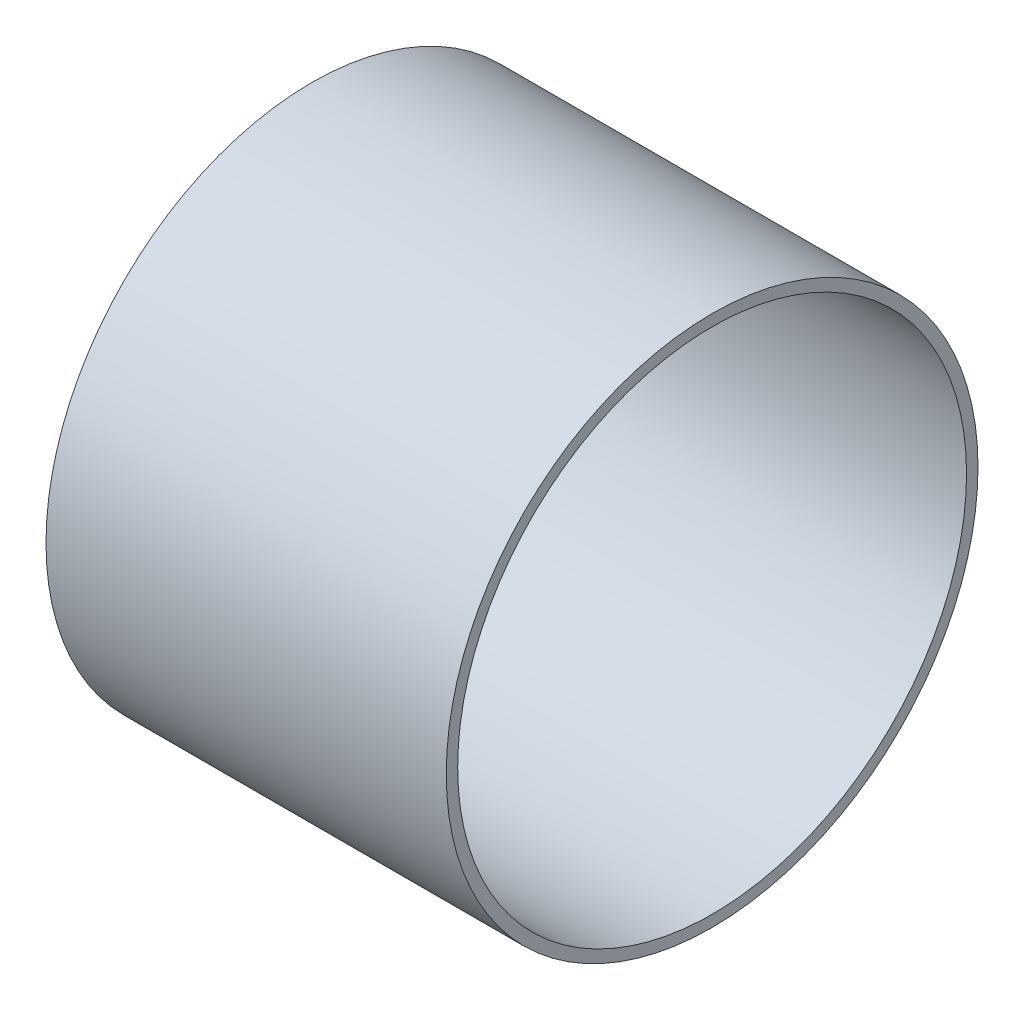
ISO-10303-21;
HEADER;
FILE_DESCRIPTION(('STEP AP214'),'2;1');
FILE_NAME('part.step','',(''),(''),'','','');
FILE_SCHEMA(('AUTOMOTIVE_DESIGN { 1 0 10303 214 1 1 1 1 }'));
ENDSEC;
DATA;
#1=APPLICATION_CONTEXT('core data for automotive mechanical design processes');
#2=APPLICATION_PROTOCOL_DEFINITION('international standard','automotive_design',2000,#1);
#3=PRODUCT_CONTEXT('',#1,'mechanical');
#4=PRODUCT('Part','Part','',(#3));
#5=PRODUCT_RELATED_PRODUCT_CATEGORY('part','',(#4));
#6=PRODUCT_DEFINITION_FORMATION('','',#4);
#7=PRODUCT_DEFINITION_CONTEXT('part definition',#1,'design');
#8=PRODUCT_DEFINITION('design','',#6,#7);
#9=PRODUCT_DEFINITION_SHAPE('','',#8);
#10=(LENGTH_UNIT() NAMED_UNIT(*) SI_UNIT(.MILLI.,.METRE.));
#11=(NAMED_UNIT(*) PLANE_ANGLE_UNIT() SI_UNIT($,.RADIAN.));
#12=(NAMED_UNIT(*) SI_UNIT($,.STERADIAN.) SOLID_ANGLE_UNIT());
#13=UNCERTAINTY_MEASURE_WITH_UNIT(LENGTH_MEASURE(1.E-05),#10,'distance_accuracy_value','');
#14=(GEOMETRIC_REPRESENTATION_CONTEXT(3) GLOBAL_UNCERTAINTY_ASSIGNED_CONTEXT((#13)) GLOBAL_UNIT_ASSIGNED_CONTEXT((#10,
#11,#12)) REPRESENTATION_CONTEXT('',''));
#15=CARTESIAN_POINT('',(0.,0.,0.));
#16=DIRECTION('',(0.,0.,1.));
#17=DIRECTION('',(1.,0.,0.));
#18=AXIS2_PLACEMENT_3D('',#15,#16,#17);
#19=CARTESIAN_POINT('',(-14.,18.6,0.));
#20=DIRECTION('',(1.,0.,0.));
#21=DIRECTION('',(0.,0.,-1.));
#22=AXIS2_PLACEMENT_3D('',#19,#20,#21);
#23=PLANE('',#22);
#24=CARTESIAN_POINT('',(-14.,0.,0.));
#25=DIRECTION('',(-1.,0.,0.));
#26=DIRECTION('',(0.,0.,1.));
#27=AXIS2_PLACEMENT_3D('',#24,#25,#26);
#28=CIRCLE('',#27,17.8);
#29=CARTESIAN_POINT('',(-14.,0.,17.8));
#30=VERTEX_POINT('',#29);
#31=EDGE_CURVE('E12',#30,#30,#28,.T.);
#32=ORIENTED_EDGE('',*,*,#31,.F.);
#33=EDGE_LOOP('',(#32));
#34=FACE_BOUND('',#33,.T.);
#35=CARTESIAN_POINT('',(-14.,0.,0.));
#36=DIRECTION('',(-1.,0.,0.));
#37=DIRECTION('',(0.,0.,1.));
#38=AXIS2_PLACEMENT_3D('',#35,#36,#37);
#39=CIRCLE('',#38,18.6);
#40=CARTESIAN_POINT('',(-14.,0.,18.6));
#41=VERTEX_POINT('',#40);
#42=EDGE_CURVE('E54',#41,#41,#39,.T.);
#43=ORIENTED_EDGE('',*,*,#42,.T.);
#44=EDGE_LOOP('',(#43));
#45=FACE_BOUND('',#44,.T.);
#46=ADVANCED_FACE('F40',(#34,#45),#23,.F.);
#47=CARTESIAN_POINT('',(-29.9250992063492,0.,0.));
#48=DIRECTION('',(-1.,0.,0.));
#49=DIRECTION('',(0.,0.,1.));
#50=AXIS2_PLACEMENT_3D('',#47,#48,#49);
#51=CYLINDRICAL_SURFACE('',#50,17.8);
#52=CARTESIAN_POINT('',(14.,0.,0.));
#53=DIRECTION('',(-1.,0.,0.));
#54=DIRECTION('',(0.,0.,1.));
#55=AXIS2_PLACEMENT_3D('',#52,#53,#54);
#56=CIRCLE('',#55,17.8);
#57=CARTESIAN_POINT('',(14.,0.,17.8));
#58=VERTEX_POINT('',#57);
#59=EDGE_CURVE('E46',#58,#58,#56,.T.);
#60=ORIENTED_EDGE('',*,*,#59,.F.);
#61=EDGE_LOOP('',(#60));
#62=FACE_BOUND('',#61,.T.);
#63=ORIENTED_EDGE('',*,*,#31,.T.);
#64=EDGE_LOOP('',(#63));
#65=FACE_BOUND('',#64,.T.);
#66=ADVANCED_FACE('F69',(#62,#65),#51,.F.);
#67=CARTESIAN_POINT('',(14.,17.8,0.));
#68=DIRECTION('',(-1.,0.,0.));
#69=DIRECTION('',(0.,0.,1.));
#70=AXIS2_PLACEMENT_3D('',#67,#68,#69);
#71=PLANE('',#70);
#72=CARTESIAN_POINT('',(14.,0.,0.));
#73=DIRECTION('',(-1.,0.,0.));
#74=DIRECTION('',(0.,0.,1.));
#75=AXIS2_PLACEMENT_3D('',#72,#73,#74);
#76=CIRCLE('',#75,18.6);
#77=CARTESIAN_POINT('',(14.,0.,18.6));
#78=VERTEX_POINT('',#77);
#79=EDGE_CURVE('E50',#78,#78,#76,.T.);
#80=ORIENTED_EDGE('',*,*,#79,.F.);
#81=EDGE_LOOP('',(#80));
#82=FACE_BOUND('',#81,.T.);
#83=ORIENTED_EDGE('',*,*,#59,.T.);
#84=EDGE_LOOP('',(#83));
#85=FACE_BOUND('',#84,.T.);
#86=ADVANCED_FACE('F64',(#82,#85),#71,.F.);
#87=CARTESIAN_POINT('',(-29.9250992063492,0.,0.));
#88=DIRECTION('',(-1.,0.,0.));
#89=DIRECTION('',(0.,0.,1.));
#90=AXIS2_PLACEMENT_3D('',#87,#88,#89);
#91=CYLINDRICAL_SURFACE('',#90,18.6);
#92=ORIENTED_EDGE('',*,*,#42,.F.);
#93=EDGE_LOOP('',(#92));
#94=FACE_BOUND('',#93,.T.);
#95=ORIENTED_EDGE('',*,*,#79,.T.);
#96=EDGE_LOOP('',(#95));
#97=FACE_BOUND('',#96,.T.);
#98=ADVANCED_FACE('F61',(#94,#97),#91,.T.);
#99=CLOSED_SHELL('',(#46,#66,#86,#98));
#100=MANIFOLD_SOLID_BREP('B2',#99);
#101=ADVANCED_BREP_SHAPE_REPRESENTATION('',(#18,#100),#14);
#102=SHAPE_DEFINITION_REPRESENTATION(#9,#101);
ENDSEC;
END-ISO-10303-21;
